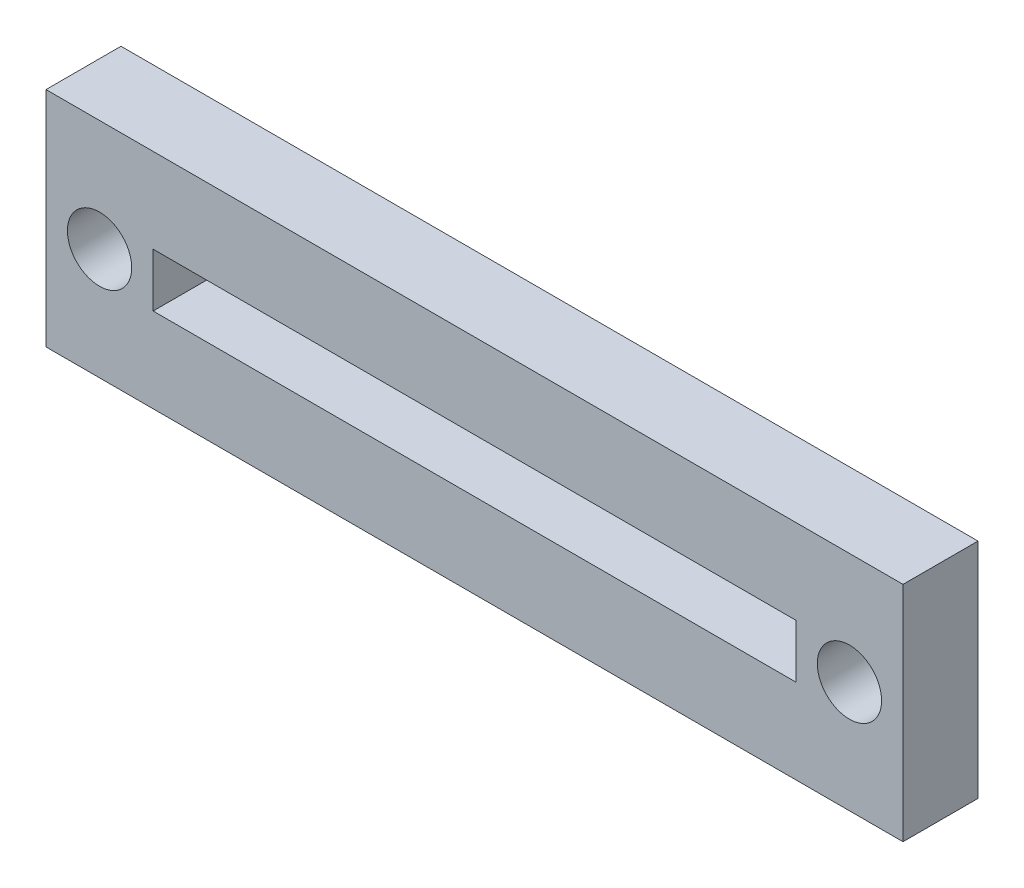
ISO-10303-21;
HEADER;
FILE_DESCRIPTION(('STEP AP214'),'2;1');
FILE_NAME('part.step','',(''),(''),'','','');
FILE_SCHEMA(('AUTOMOTIVE_DESIGN { 1 0 10303 214 1 1 1 1 }'));
ENDSEC;
DATA;
#1=APPLICATION_CONTEXT('core data for automotive mechanical design processes');
#2=APPLICATION_PROTOCOL_DEFINITION('international standard','automotive_design',2000,#1);
#3=PRODUCT_CONTEXT('',#1,'mechanical');
#4=PRODUCT('Part','Part','',(#3));
#5=PRODUCT_RELATED_PRODUCT_CATEGORY('part','',(#4));
#6=PRODUCT_DEFINITION_FORMATION('','',#4);
#7=PRODUCT_DEFINITION_CONTEXT('part definition',#1,'design');
#8=PRODUCT_DEFINITION('design','',#6,#7);
#9=PRODUCT_DEFINITION_SHAPE('','',#8);
#10=(LENGTH_UNIT() NAMED_UNIT(*) SI_UNIT(.MILLI.,.METRE.));
#11=(NAMED_UNIT(*) PLANE_ANGLE_UNIT() SI_UNIT($,.RADIAN.));
#12=(NAMED_UNIT(*) SI_UNIT($,.STERADIAN.) SOLID_ANGLE_UNIT());
#13=UNCERTAINTY_MEASURE_WITH_UNIT(LENGTH_MEASURE(1.E-05),#10,'distance_accuracy_value','');
#14=(GEOMETRIC_REPRESENTATION_CONTEXT(3) GLOBAL_UNCERTAINTY_ASSIGNED_CONTEXT((#13)) GLOBAL_UNIT_ASSIGNED_CONTEXT((#10,
#11,#12)) REPRESENTATION_CONTEXT('',''));
#15=CARTESIAN_POINT('',(0.,0.,0.));
#16=DIRECTION('',(0.,0.,1.));
#17=DIRECTION('',(1.,0.,0.));
#18=AXIS2_PLACEMENT_3D('',#15,#16,#17);
#19=CARTESIAN_POINT('',(0.,0.,-3.5));
#20=DIRECTION('',(0.,0.,-1.));
#21=DIRECTION('',(-1.,0.,0.));
#22=AXIS2_PLACEMENT_3D('',#19,#20,#21);
#23=PLANE('',#22);
#24=CARTESIAN_POINT('',(-2.5,0.,-3.5));
#25=DIRECTION('',(0.,0.,-1.));
#26=DIRECTION('',(-1.,0.,0.));
#27=AXIS2_PLACEMENT_3D('',#24,#25,#26);
#28=CIRCLE('',#27,1.5);
#29=CARTESIAN_POINT('',(-4.00000000000001,0.,-3.5));
#30=VERTEX_POINT('',#29);
#31=EDGE_CURVE('E126',#30,#30,#28,.T.);
#32=ORIENTED_EDGE('',*,*,#31,.F.);
#33=EDGE_LOOP('',(#32));
#34=FACE_BOUND('',#33,.T.);
#35=DIRECTION('',(0.,1.,0.));
#36=VECTOR('',#35,1.);
#37=CARTESIAN_POINT('',(-40.,-5.20210465406498,-3.5));
#38=LINE('',#37,#36);
#39=CARTESIAN_POINT('',(-40.,-5.20210465406498,-3.5));
#40=VERTEX_POINT('',#39);
#41=CARTESIAN_POINT('',(-40.,5.20210465406504,-3.5));
#42=VERTEX_POINT('',#41);
#43=EDGE_CURVE('E136',#40,#42,#38,.T.);
#44=ORIENTED_EDGE('',*,*,#43,.T.);
#45=DIRECTION('',(1.,0.,0.));
#46=VECTOR('',#45,1.);
#47=CARTESIAN_POINT('',(-40.,5.20210465406504,-3.5));
#48=LINE('',#47,#46);
#49=CARTESIAN_POINT('',(0.,5.20210465406504,-3.5));
#50=VERTEX_POINT('',#49);
#51=EDGE_CURVE('E139',#42,#50,#48,.T.);
#52=ORIENTED_EDGE('',*,*,#51,.T.);
#53=DIRECTION('',(0.,-1.,0.));
#54=VECTOR('',#53,1.);
#55=CARTESIAN_POINT('',(0.,-5.20210465406498,-3.5));
#56=LINE('',#55,#54);
#57=CARTESIAN_POINT('',(0.,-5.20210465406498,-3.5));
#58=VERTEX_POINT('',#57);
#59=EDGE_CURVE('E142',#50,#58,#56,.T.);
#60=ORIENTED_EDGE('',*,*,#59,.T.);
#61=DIRECTION('',(-1.,0.,0.));
#62=VECTOR('',#61,1.);
#63=CARTESIAN_POINT('',(-40.,-5.20210465406498,-3.5));
#64=LINE('',#63,#62);
#65=EDGE_CURVE('E144',#58,#40,#64,.T.);
#66=ORIENTED_EDGE('',*,*,#65,.T.);
#67=EDGE_LOOP('',(#44,#52,#60,#66));
#68=FACE_BOUND('',#67,.T.);
#69=DIRECTION('',(-1.,0.,0.));
#70=VECTOR('',#69,1.);
#71=CARTESIAN_POINT('',(-5.,-1.25,-3.5));
#72=LINE('',#71,#70);
#73=CARTESIAN_POINT('',(-5.,-1.25,-3.5));
#74=VERTEX_POINT('',#73);
#75=CARTESIAN_POINT('',(-35.,-1.25,-3.5));
#76=VERTEX_POINT('',#75);
#77=EDGE_CURVE('E105',#74,#76,#72,.T.);
#78=ORIENTED_EDGE('',*,*,#77,.F.);
#79=DIRECTION('',(0.,-1.,0.));
#80=VECTOR('',#79,1.);
#81=CARTESIAN_POINT('',(-5.,-1.25,-3.5));
#82=LINE('',#81,#80);
#83=CARTESIAN_POINT('',(-5.,1.25,-3.5));
#84=VERTEX_POINT('',#83);
#85=EDGE_CURVE('E97',#84,#74,#82,.T.);
#86=ORIENTED_EDGE('',*,*,#85,.F.);
#87=DIRECTION('',(1.,0.,0.));
#88=VECTOR('',#87,1.);
#89=CARTESIAN_POINT('',(-5.,1.25,-3.5));
#90=LINE('',#89,#88);
#91=CARTESIAN_POINT('',(-35.,1.25,-3.5));
#92=VERTEX_POINT('',#91);
#93=EDGE_CURVE('E120',#92,#84,#90,.T.);
#94=ORIENTED_EDGE('',*,*,#93,.F.);
#95=DIRECTION('',(0.,1.,0.));
#96=VECTOR('',#95,1.);
#97=CARTESIAN_POINT('',(-35.,-1.25,-3.5));
#98=LINE('',#97,#96);
#99=EDGE_CURVE('E118',#76,#92,#98,.T.);
#100=ORIENTED_EDGE('',*,*,#99,.F.);
#101=EDGE_LOOP('',(#78,#86,#94,#100));
#102=FACE_BOUND('',#101,.T.);
#103=CARTESIAN_POINT('',(-37.5,0.,-3.5));
#104=DIRECTION('',(0.,0.,-1.));
#105=DIRECTION('',(-1.,0.,0.));
#106=AXIS2_PLACEMENT_3D('',#103,#104,#105);
#107=CIRCLE('',#106,1.5);
#108=CARTESIAN_POINT('',(-39.,0.,-3.5));
#109=VERTEX_POINT('',#108);
#110=EDGE_CURVE('E227',#109,#109,#107,.T.);
#111=ORIENTED_EDGE('',*,*,#110,.F.);
#112=EDGE_LOOP('',(#111));
#113=FACE_BOUND('',#112,.T.);
#114=ADVANCED_FACE('F32',(#34,#68,#102,#113),#23,.T.);
#115=CARTESIAN_POINT('',(0.,0.,0.));
#116=DIRECTION('',(0.,0.,-1.));
#117=DIRECTION('',(-1.,0.,0.));
#118=AXIS2_PLACEMENT_3D('',#115,#116,#117);
#119=PLANE('',#118);
#120=CARTESIAN_POINT('',(-2.5,0.,0.));
#121=DIRECTION('',(0.,0.,-1.));
#122=DIRECTION('',(-1.,0.,0.));
#123=AXIS2_PLACEMENT_3D('',#120,#121,#122);
#124=CIRCLE('',#123,1.5);
#125=CARTESIAN_POINT('',(-4.00000000000001,0.,0.));
#126=VERTEX_POINT('',#125);
#127=EDGE_CURVE('E233',#126,#126,#124,.T.);
#128=ORIENTED_EDGE('',*,*,#127,.T.);
#129=EDGE_LOOP('',(#128));
#130=FACE_BOUND('',#129,.T.);
#131=DIRECTION('',(0.,1.,0.));
#132=VECTOR('',#131,1.);
#133=CARTESIAN_POINT('',(-40.,-5.20210465406498,0.));
#134=LINE('',#133,#132);
#135=CARTESIAN_POINT('',(-40.,-5.20210465406498,0.));
#136=VERTEX_POINT('',#135);
#137=CARTESIAN_POINT('',(-40.,5.20210465406504,0.));
#138=VERTEX_POINT('',#137);
#139=EDGE_CURVE('E113',#136,#138,#134,.T.);
#140=ORIENTED_EDGE('',*,*,#139,.F.);
#141=DIRECTION('',(-1.,0.,0.));
#142=VECTOR('',#141,1.);
#143=CARTESIAN_POINT('',(-40.,-5.20210465406498,0.));
#144=LINE('',#143,#142);
#145=CARTESIAN_POINT('',(0.,-5.20210465406498,0.));
#146=VERTEX_POINT('',#145);
#147=EDGE_CURVE('E140',#146,#136,#144,.T.);
#148=ORIENTED_EDGE('',*,*,#147,.F.);
#149=DIRECTION('',(0.,-1.,0.));
#150=VECTOR('',#149,1.);
#151=CARTESIAN_POINT('',(0.,-5.20210465406498,0.));
#152=LINE('',#151,#150);
#153=CARTESIAN_POINT('',(0.,5.20210465406504,0.));
#154=VERTEX_POINT('',#153);
#155=EDGE_CURVE('E151',#154,#146,#152,.T.);
#156=ORIENTED_EDGE('',*,*,#155,.F.);
#157=DIRECTION('',(1.,0.,0.));
#158=VECTOR('',#157,1.);
#159=CARTESIAN_POINT('',(-40.,5.20210465406504,0.));
#160=LINE('',#159,#158);
#161=EDGE_CURVE('E149',#138,#154,#160,.T.);
#162=ORIENTED_EDGE('',*,*,#161,.F.);
#163=EDGE_LOOP('',(#140,#148,#156,#162));
#164=FACE_BOUND('',#163,.T.);
#165=DIRECTION('',(0.,-1.,0.));
#166=VECTOR('',#165,1.);
#167=CARTESIAN_POINT('',(-5.,-1.25,0.));
#168=LINE('',#167,#166);
#169=CARTESIAN_POINT('',(-5.,1.25,0.));
#170=VERTEX_POINT('',#169);
#171=CARTESIAN_POINT('',(-5.,-1.25,0.));
#172=VERTEX_POINT('',#171);
#173=EDGE_CURVE('E55',#170,#172,#168,.T.);
#174=ORIENTED_EDGE('',*,*,#173,.T.);
#175=DIRECTION('',(-1.,0.,0.));
#176=VECTOR('',#175,1.);
#177=CARTESIAN_POINT('',(-5.,-1.25,0.));
#178=LINE('',#177,#176);
#179=CARTESIAN_POINT('',(-35.,-1.25,0.));
#180=VERTEX_POINT('',#179);
#181=EDGE_CURVE('E112',#172,#180,#178,.T.);
#182=ORIENTED_EDGE('',*,*,#181,.T.);
#183=DIRECTION('',(0.,1.,0.));
#184=VECTOR('',#183,1.);
#185=CARTESIAN_POINT('',(-35.,-1.25,0.));
#186=LINE('',#185,#184);
#187=CARTESIAN_POINT('',(-35.,1.25,0.));
#188=VERTEX_POINT('',#187);
#189=EDGE_CURVE('E128',#180,#188,#186,.T.);
#190=ORIENTED_EDGE('',*,*,#189,.T.);
#191=DIRECTION('',(1.,0.,0.));
#192=VECTOR('',#191,1.);
#193=CARTESIAN_POINT('',(-5.,1.25,0.));
#194=LINE('',#193,#192);
#195=EDGE_CURVE('E106',#188,#170,#194,.T.);
#196=ORIENTED_EDGE('',*,*,#195,.T.);
#197=EDGE_LOOP('',(#174,#182,#190,#196));
#198=FACE_BOUND('',#197,.T.);
#199=CARTESIAN_POINT('',(-37.5,0.,0.));
#200=DIRECTION('',(0.,0.,-1.));
#201=DIRECTION('',(-1.,0.,0.));
#202=AXIS2_PLACEMENT_3D('',#199,#200,#201);
#203=CIRCLE('',#202,1.5);
#204=CARTESIAN_POINT('',(-39.,0.,0.));
#205=VERTEX_POINT('',#204);
#206=EDGE_CURVE('E230',#205,#205,#203,.T.);
#207=ORIENTED_EDGE('',*,*,#206,.T.);
#208=EDGE_LOOP('',(#207));
#209=FACE_BOUND('',#208,.T.);
#210=ADVANCED_FACE('F169',(#130,#164,#198,#209),#119,.F.);
#211=CARTESIAN_POINT('',(-40.,-5.20210465406498,-3.5));
#212=DIRECTION('',(1.,0.,0.));
#213=DIRECTION('',(0.,0.,-1.));
#214=AXIS2_PLACEMENT_3D('',#211,#212,#213);
#215=PLANE('',#214);
#216=ORIENTED_EDGE('',*,*,#139,.T.);
#217=DIRECTION('',(0.,0.,1.));
#218=VECTOR('',#217,1.);
#219=CARTESIAN_POINT('',(-40.,5.20210465406504,-3.5));
#220=LINE('',#219,#218);
#221=EDGE_CURVE('E11',#42,#138,#220,.T.);
#222=ORIENTED_EDGE('',*,*,#221,.F.);
#223=ORIENTED_EDGE('',*,*,#43,.F.);
#224=DIRECTION('',(0.,0.,1.));
#225=VECTOR('',#224,1.);
#226=CARTESIAN_POINT('',(-40.,-5.20210465406498,-3.5));
#227=LINE('',#226,#225);
#228=EDGE_CURVE('E146',#40,#136,#227,.T.);
#229=ORIENTED_EDGE('',*,*,#228,.T.);
#230=EDGE_LOOP('',(#216,#222,#223,#229));
#231=FACE_BOUND('',#230,.T.);
#232=ADVANCED_FACE('F34',(#231),#215,.F.);
#233=CARTESIAN_POINT('',(-40.,5.20210465406504,-3.5));
#234=DIRECTION('',(0.,-1.,0.));
#235=DIRECTION('',(0.,0.,-1.));
#236=AXIS2_PLACEMENT_3D('',#233,#234,#235);
#237=PLANE('',#236);
#238=ORIENTED_EDGE('',*,*,#161,.T.);
#239=DIRECTION('',(0.,0.,1.));
#240=VECTOR('',#239,1.);
#241=CARTESIAN_POINT('',(0.,5.20210465406504,-3.5));
#242=LINE('',#241,#240);
#243=EDGE_CURVE('E40',#50,#154,#242,.T.);
#244=ORIENTED_EDGE('',*,*,#243,.F.);
#245=ORIENTED_EDGE('',*,*,#51,.F.);
#246=ORIENTED_EDGE('',*,*,#221,.T.);
#247=EDGE_LOOP('',(#238,#244,#245,#246));
#248=FACE_BOUND('',#247,.T.);
#249=ADVANCED_FACE('F179',(#248),#237,.F.);
#250=CARTESIAN_POINT('',(0.,-5.20210465406498,-3.5));
#251=DIRECTION('',(-1.,0.,0.));
#252=DIRECTION('',(0.,0.,1.));
#253=AXIS2_PLACEMENT_3D('',#250,#251,#252);
#254=PLANE('',#253);
#255=ORIENTED_EDGE('',*,*,#155,.T.);
#256=DIRECTION('',(0.,0.,1.));
#257=VECTOR('',#256,1.);
#258=CARTESIAN_POINT('',(0.,-5.20210465406498,-3.5));
#259=LINE('',#258,#257);
#260=EDGE_CURVE('E156',#58,#146,#259,.T.);
#261=ORIENTED_EDGE('',*,*,#260,.F.);
#262=ORIENTED_EDGE('',*,*,#59,.F.);
#263=ORIENTED_EDGE('',*,*,#243,.T.);
#264=EDGE_LOOP('',(#255,#261,#262,#263));
#265=FACE_BOUND('',#264,.T.);
#266=ADVANCED_FACE('F163',(#265),#254,.F.);
#267=CARTESIAN_POINT('',(-40.,-5.20210465406498,-3.5));
#268=DIRECTION('',(0.,1.,0.));
#269=DIRECTION('',(0.,0.,1.));
#270=AXIS2_PLACEMENT_3D('',#267,#268,#269);
#271=PLANE('',#270);
#272=ORIENTED_EDGE('',*,*,#147,.T.);
#273=ORIENTED_EDGE('',*,*,#228,.F.);
#274=ORIENTED_EDGE('',*,*,#65,.F.);
#275=ORIENTED_EDGE('',*,*,#260,.T.);
#276=EDGE_LOOP('',(#272,#273,#274,#275));
#277=FACE_BOUND('',#276,.T.);
#278=ADVANCED_FACE('F173',(#277),#271,.F.);
#279=CARTESIAN_POINT('',(-5.,-1.25,-3.5));
#280=DIRECTION('',(-1.,0.,0.));
#281=DIRECTION('',(0.,0.,1.));
#282=AXIS2_PLACEMENT_3D('',#279,#280,#281);
#283=PLANE('',#282);
#284=ORIENTED_EDGE('',*,*,#173,.F.);
#285=DIRECTION('',(0.,0.,1.));
#286=VECTOR('',#285,1.);
#287=CARTESIAN_POINT('',(-5.,1.25,-3.5));
#288=LINE('',#287,#286);
#289=EDGE_CURVE('E101',#84,#170,#288,.T.);
#290=ORIENTED_EDGE('',*,*,#289,.F.);
#291=ORIENTED_EDGE('',*,*,#85,.T.);
#292=DIRECTION('',(0.,0.,1.));
#293=VECTOR('',#292,1.);
#294=CARTESIAN_POINT('',(-5.,-1.25,-3.5));
#295=LINE('',#294,#293);
#296=EDGE_CURVE('E100',#74,#172,#295,.T.);
#297=ORIENTED_EDGE('',*,*,#296,.T.);
#298=EDGE_LOOP('',(#284,#290,#291,#297));
#299=FACE_BOUND('',#298,.T.);
#300=ADVANCED_FACE('F99',(#299),#283,.T.);
#301=CARTESIAN_POINT('',(-5.,-1.25,-3.5));
#302=DIRECTION('',(0.,1.,0.));
#303=DIRECTION('',(0.,0.,1.));
#304=AXIS2_PLACEMENT_3D('',#301,#302,#303);
#305=PLANE('',#304);
#306=ORIENTED_EDGE('',*,*,#181,.F.);
#307=ORIENTED_EDGE('',*,*,#296,.F.);
#308=ORIENTED_EDGE('',*,*,#77,.T.);
#309=DIRECTION('',(0.,0.,1.));
#310=VECTOR('',#309,1.);
#311=CARTESIAN_POINT('',(-35.,-1.25,-3.5));
#312=LINE('',#311,#310);
#313=EDGE_CURVE('E114',#76,#180,#312,.T.);
#314=ORIENTED_EDGE('',*,*,#313,.T.);
#315=EDGE_LOOP('',(#306,#307,#308,#314));
#316=FACE_BOUND('',#315,.T.);
#317=ADVANCED_FACE('F109',(#316),#305,.T.);
#318=CARTESIAN_POINT('',(-35.,-1.25,-3.5));
#319=DIRECTION('',(1.,0.,0.));
#320=DIRECTION('',(0.,0.,-1.));
#321=AXIS2_PLACEMENT_3D('',#318,#319,#320);
#322=PLANE('',#321);
#323=ORIENTED_EDGE('',*,*,#189,.F.);
#324=ORIENTED_EDGE('',*,*,#313,.F.);
#325=ORIENTED_EDGE('',*,*,#99,.T.);
#326=DIRECTION('',(0.,0.,1.));
#327=VECTOR('',#326,1.);
#328=CARTESIAN_POINT('',(-35.,1.25,-3.5));
#329=LINE('',#328,#327);
#330=EDGE_CURVE('E47',#92,#188,#329,.T.);
#331=ORIENTED_EDGE('',*,*,#330,.T.);
#332=EDGE_LOOP('',(#323,#324,#325,#331));
#333=FACE_BOUND('',#332,.T.);
#334=ADVANCED_FACE('F205',(#333),#322,.T.);
#335=CARTESIAN_POINT('',(-5.,1.25,-3.5));
#336=DIRECTION('',(0.,-1.,0.));
#337=DIRECTION('',(0.,0.,-1.));
#338=AXIS2_PLACEMENT_3D('',#335,#336,#337);
#339=PLANE('',#338);
#340=ORIENTED_EDGE('',*,*,#195,.F.);
#341=ORIENTED_EDGE('',*,*,#330,.F.);
#342=ORIENTED_EDGE('',*,*,#93,.T.);
#343=ORIENTED_EDGE('',*,*,#289,.T.);
#344=EDGE_LOOP('',(#340,#341,#342,#343));
#345=FACE_BOUND('',#344,.T.);
#346=ADVANCED_FACE('F209',(#345),#339,.T.);
#347=CARTESIAN_POINT('',(-2.5,0.,-3.5));
#348=DIRECTION('',(0.,0.,1.));
#349=DIRECTION('',(1.,0.,0.));
#350=AXIS2_PLACEMENT_3D('',#347,#348,#349);
#351=CYLINDRICAL_SURFACE('',#350,1.5);
#352=ORIENTED_EDGE('',*,*,#31,.T.);
#353=EDGE_LOOP('',(#352));
#354=FACE_BOUND('',#353,.T.);
#355=ORIENTED_EDGE('',*,*,#127,.F.);
#356=EDGE_LOOP('',(#355));
#357=FACE_BOUND('',#356,.T.);
#358=ADVANCED_FACE('F215',(#354,#357),#351,.F.);
#359=CARTESIAN_POINT('',(-37.5,0.,-3.5));
#360=DIRECTION('',(0.,0.,1.));
#361=DIRECTION('',(1.,0.,0.));
#362=AXIS2_PLACEMENT_3D('',#359,#360,#361);
#363=CYLINDRICAL_SURFACE('',#362,1.5);
#364=ORIENTED_EDGE('',*,*,#110,.T.);
#365=EDGE_LOOP('',(#364));
#366=FACE_BOUND('',#365,.T.);
#367=ORIENTED_EDGE('',*,*,#206,.F.);
#368=EDGE_LOOP('',(#367));
#369=FACE_BOUND('',#368,.T.);
#370=ADVANCED_FACE('F218',(#366,#369),#363,.F.);
#371=CLOSED_SHELL('',(#114,#210,#232,#249,#266,#278,#300,#317,#334,#346,#358,#370));
#372=MANIFOLD_SOLID_BREP('B2',#371);
#373=ADVANCED_BREP_SHAPE_REPRESENTATION('',(#18,#372),#14);
#374=SHAPE_DEFINITION_REPRESENTATION(#9,#373);
ENDSEC;
END-ISO-10303-21;
